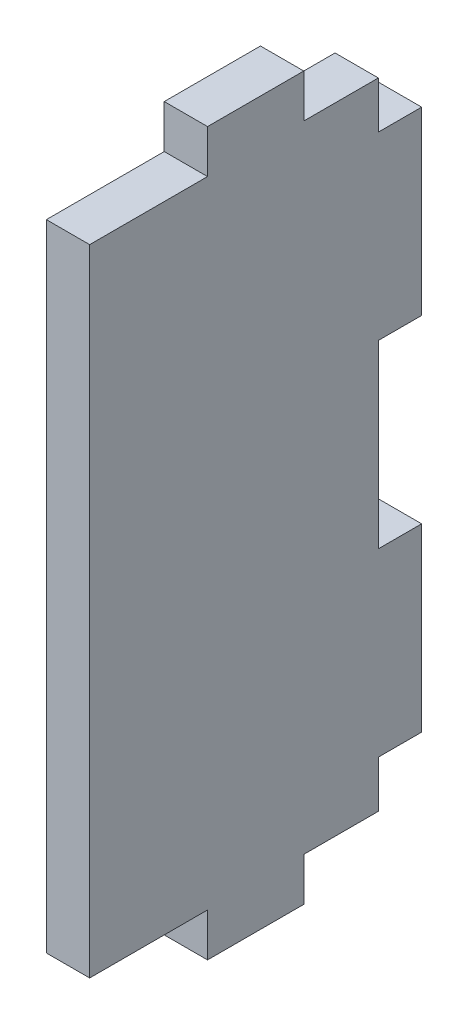
ISO-10303-21;
HEADER;
FILE_DESCRIPTION(('STEP AP214'),'2;1');
FILE_NAME('part.step','',(''),(''),'','','');
FILE_SCHEMA(('AUTOMOTIVE_DESIGN { 1 0 10303 214 1 1 1 1 }'));
ENDSEC;
DATA;
#1=APPLICATION_CONTEXT('core data for automotive mechanical design processes');
#2=APPLICATION_PROTOCOL_DEFINITION('international standard','automotive_design',2000,#1);
#3=PRODUCT_CONTEXT('',#1,'mechanical');
#4=PRODUCT('Part','Part','',(#3));
#5=PRODUCT_RELATED_PRODUCT_CATEGORY('part','',(#4));
#6=PRODUCT_DEFINITION_FORMATION('','',#4);
#7=PRODUCT_DEFINITION_CONTEXT('part definition',#1,'design');
#8=PRODUCT_DEFINITION('design','',#6,#7);
#9=PRODUCT_DEFINITION_SHAPE('','',#8);
#10=(LENGTH_UNIT() NAMED_UNIT(*) SI_UNIT(.MILLI.,.METRE.));
#11=(NAMED_UNIT(*) PLANE_ANGLE_UNIT() SI_UNIT($,.RADIAN.));
#12=(NAMED_UNIT(*) SI_UNIT($,.STERADIAN.) SOLID_ANGLE_UNIT());
#13=UNCERTAINTY_MEASURE_WITH_UNIT(LENGTH_MEASURE(1.E-05),#10,'distance_accuracy_value','');
#14=(GEOMETRIC_REPRESENTATION_CONTEXT(3) GLOBAL_UNCERTAINTY_ASSIGNED_CONTEXT((#13)) GLOBAL_UNIT_ASSIGNED_CONTEXT((#10,
#11,#12)) REPRESENTATION_CONTEXT('',''));
#15=CARTESIAN_POINT('',(0.,0.,0.));
#16=DIRECTION('',(0.,0.,1.));
#17=DIRECTION('',(1.,0.,0.));
#18=AXIS2_PLACEMENT_3D('',#15,#16,#17);
#19=CARTESIAN_POINT('',(0.,75.,69.));
#20=DIRECTION('',(0.,-1.,0.));
#21=DIRECTION('',(0.,0.,-1.));
#22=AXIS2_PLACEMENT_3D('',#19,#20,#21);
#23=PLANE('',#22);
#24=DIRECTION('',(0.,0.,-1.));
#25=VECTOR('',#24,1.);
#26=CARTESIAN_POINT('',(-140.,75.,69.));
#27=LINE('',#26,#25);
#28=CARTESIAN_POINT('',(-140.,75.,44.5));
#29=VERTEX_POINT('',#28);
#30=CARTESIAN_POINT('',(-140.,75.,24.5));
#31=VERTEX_POINT('',#30);
#32=EDGE_CURVE('E191',#29,#31,#27,.T.);
#33=ORIENTED_EDGE('',*,*,#32,.F.);
#34=DIRECTION('',(-1.,0.,0.));
#35=VECTOR('',#34,1.);
#36=CARTESIAN_POINT('',(250.,75.,44.5));
#37=LINE('',#36,#35);
#38=CARTESIAN_POINT('',(-131.,75.,44.5));
#39=VERTEX_POINT('',#38);
#40=EDGE_CURVE('E171',#39,#29,#37,.T.);
#41=ORIENTED_EDGE('',*,*,#40,.F.);
#42=DIRECTION('',(0.,0.,-1.));
#43=VECTOR('',#42,1.);
#44=CARTESIAN_POINT('',(-131.,75.,69.));
#45=LINE('',#44,#43);
#46=CARTESIAN_POINT('',(-131.,75.,24.5));
#47=VERTEX_POINT('',#46);
#48=EDGE_CURVE('E231',#39,#47,#45,.T.);
#49=ORIENTED_EDGE('',*,*,#48,.T.);
#50=DIRECTION('',(-1.,0.,0.));
#51=VECTOR('',#50,1.);
#52=CARTESIAN_POINT('',(250.,75.,24.5));
#53=LINE('',#52,#51);
#54=EDGE_CURVE('E196',#47,#31,#53,.T.);
#55=ORIENTED_EDGE('',*,*,#54,.T.);
#56=EDGE_LOOP('',(#33,#41,#49,#55));
#57=FACE_BOUND('',#56,.T.);
#58=ADVANCED_FACE('F35',(#57),#23,.F.);
#59=CARTESIAN_POINT('',(-140.,0.,69.));
#60=DIRECTION('',(-1.,0.,0.));
#61=DIRECTION('',(0.,0.,1.));
#62=AXIS2_PLACEMENT_3D('',#59,#60,#61);
#63=PLANE('',#62);
#64=DIRECTION('',(0.,1.,0.));
#65=VECTOR('',#64,1.);
#66=CARTESIAN_POINT('',(-140.,0.,9.));
#67=LINE('',#66,#65);
#68=CARTESIAN_POINT('',(-140.,-66.,9.));
#69=VERTEX_POINT('',#68);
#70=CARTESIAN_POINT('',(-140.,-56.25,9.));
#71=VERTEX_POINT('',#70);
#72=EDGE_CURVE('E240',#69,#71,#67,.T.);
#73=ORIENTED_EDGE('',*,*,#72,.F.);
#74=DIRECTION('',(0.,0.,1.));
#75=VECTOR('',#74,1.);
#76=CARTESIAN_POINT('',(-140.,-66.,0.));
#77=LINE('',#76,#75);
#78=CARTESIAN_POINT('',(-140.,-66.,24.5));
#79=VERTEX_POINT('',#78);
#80=EDGE_CURVE('E313',#69,#79,#77,.T.);
#81=ORIENTED_EDGE('',*,*,#80,.T.);
#82=DIRECTION('',(0.,1.,0.));
#83=VECTOR('',#82,1.);
#84=CARTESIAN_POINT('',(-140.,0.,24.5));
#85=LINE('',#84,#83);
#86=CARTESIAN_POINT('',(-140.,-75.,24.5));
#87=VERTEX_POINT('',#86);
#88=EDGE_CURVE('E318',#87,#79,#85,.T.);
#89=ORIENTED_EDGE('',*,*,#88,.F.);
#90=DIRECTION('',(0.,0.,-1.));
#91=VECTOR('',#90,1.);
#92=CARTESIAN_POINT('',(-140.,-75.,69.));
#93=LINE('',#92,#91);
#94=CARTESIAN_POINT('',(-140.,-75.,44.5));
#95=VERTEX_POINT('',#94);
#96=EDGE_CURVE('E198',#95,#87,#93,.T.);
#97=ORIENTED_EDGE('',*,*,#96,.F.);
#98=DIRECTION('',(0.,1.,0.));
#99=VECTOR('',#98,1.);
#100=CARTESIAN_POINT('',(-140.,0.,44.5));
#101=LINE('',#100,#99);
#102=CARTESIAN_POINT('',(-140.,-66.,44.5));
#103=VERTEX_POINT('',#102);
#104=EDGE_CURVE('E323',#95,#103,#101,.T.);
#105=ORIENTED_EDGE('',*,*,#104,.T.);
#106=DIRECTION('',(0.,0.,1.));
#107=VECTOR('',#106,1.);
#108=CARTESIAN_POINT('',(-140.,-66.,0.));
#109=LINE('',#108,#107);
#110=CARTESIAN_POINT('',(-140.,-66.,69.));
#111=VERTEX_POINT('',#110);
#112=EDGE_CURVE('E315',#103,#111,#109,.T.);
#113=ORIENTED_EDGE('',*,*,#112,.T.);
#114=DIRECTION('',(0.,1.,0.));
#115=VECTOR('',#114,1.);
#116=CARTESIAN_POINT('',(-140.,0.,69.));
#117=LINE('',#116,#115);
#118=CARTESIAN_POINT('',(-140.,66.,69.));
#119=VERTEX_POINT('',#118);
#120=EDGE_CURVE('E237',#111,#119,#117,.T.);
#121=ORIENTED_EDGE('',*,*,#120,.T.);
#122=DIRECTION('',(0.,0.,1.));
#123=VECTOR('',#122,1.);
#124=CARTESIAN_POINT('',(-140.,66.,0.));
#125=LINE('',#124,#123);
#126=CARTESIAN_POINT('',(-140.,66.,44.5));
#127=VERTEX_POINT('',#126);
#128=EDGE_CURVE('E184',#127,#119,#125,.T.);
#129=ORIENTED_EDGE('',*,*,#128,.F.);
#130=DIRECTION('',(0.,-1.,0.));
#131=VECTOR('',#130,1.);
#132=CARTESIAN_POINT('',(-140.,0.,44.5));
#133=LINE('',#132,#131);
#134=EDGE_CURVE('E175',#29,#127,#133,.T.);
#135=ORIENTED_EDGE('',*,*,#134,.F.);
#136=ORIENTED_EDGE('',*,*,#32,.T.);
#137=DIRECTION('',(0.,-1.,0.));
#138=VECTOR('',#137,1.);
#139=CARTESIAN_POINT('',(-140.,0.,24.5));
#140=LINE('',#139,#138);
#141=CARTESIAN_POINT('',(-140.,66.,24.5));
#142=VERTEX_POINT('',#141);
#143=EDGE_CURVE('E309',#31,#142,#140,.T.);
#144=ORIENTED_EDGE('',*,*,#143,.T.);
#145=DIRECTION('',(0.,0.,1.));
#146=VECTOR('',#145,1.);
#147=CARTESIAN_POINT('',(-140.,66.,0.));
#148=LINE('',#147,#146);
#149=CARTESIAN_POINT('',(-140.,66.,9.));
#150=VERTEX_POINT('',#149);
#151=EDGE_CURVE('E306',#150,#142,#148,.T.);
#152=ORIENTED_EDGE('',*,*,#151,.F.);
#153=CARTESIAN_POINT('',(-140.,56.25,9.));
#154=VERTEX_POINT('',#153);
#155=EDGE_CURVE('E243',#154,#150,#67,.T.);
#156=ORIENTED_EDGE('',*,*,#155,.F.);
#157=DIRECTION('',(0.,0.,-1.));
#158=VECTOR('',#157,1.);
#159=CARTESIAN_POINT('',(-140.,56.25,47.5648803965473));
#160=LINE('',#159,#158);
#161=CARTESIAN_POINT('',(-140.,56.25,0.));
#162=VERTEX_POINT('',#161);
#163=EDGE_CURVE('E252',#154,#162,#160,.T.);
#164=ORIENTED_EDGE('',*,*,#163,.T.);
#165=DIRECTION('',(0.,-1.,0.));
#166=VECTOR('',#165,1.);
#167=CARTESIAN_POINT('',(-140.,0.,0.));
#168=LINE('',#167,#166);
#169=CARTESIAN_POINT('',(-140.,18.75,0.));
#170=VERTEX_POINT('',#169);
#171=EDGE_CURVE('E261',#162,#170,#168,.T.);
#172=ORIENTED_EDGE('',*,*,#171,.T.);
#173=DIRECTION('',(0.,0.,-1.));
#174=VECTOR('',#173,1.);
#175=CARTESIAN_POINT('',(-140.,18.75,47.5648803965473));
#176=LINE('',#175,#174);
#177=CARTESIAN_POINT('',(-140.,18.75,9.00000000000001));
#178=VERTEX_POINT('',#177);
#179=EDGE_CURVE('E254',#178,#170,#176,.T.);
#180=ORIENTED_EDGE('',*,*,#179,.F.);
#181=CARTESIAN_POINT('',(-140.,-18.75,9.));
#182=VERTEX_POINT('',#181);
#183=EDGE_CURVE('E242',#182,#178,#67,.T.);
#184=ORIENTED_EDGE('',*,*,#183,.F.);
#185=DIRECTION('',(0.,0.,-1.));
#186=VECTOR('',#185,1.);
#187=CARTESIAN_POINT('',(-140.,-18.75,47.5648803965473));
#188=LINE('',#187,#186);
#189=CARTESIAN_POINT('',(-140.,-18.75,0.));
#190=VERTEX_POINT('',#189);
#191=EDGE_CURVE('E273',#182,#190,#188,.T.);
#192=ORIENTED_EDGE('',*,*,#191,.T.);
#193=DIRECTION('',(0.,-1.,0.));
#194=VECTOR('',#193,1.);
#195=CARTESIAN_POINT('',(-140.,0.,0.));
#196=LINE('',#195,#194);
#197=CARTESIAN_POINT('',(-140.,-56.25,0.));
#198=VERTEX_POINT('',#197);
#199=EDGE_CURVE('E288',#190,#198,#196,.T.);
#200=ORIENTED_EDGE('',*,*,#199,.T.);
#201=DIRECTION('',(0.,0.,-1.));
#202=VECTOR('',#201,1.);
#203=CARTESIAN_POINT('',(-140.,-56.25,47.5648803965473));
#204=LINE('',#203,#202);
#205=EDGE_CURVE('E276',#71,#198,#204,.T.);
#206=ORIENTED_EDGE('',*,*,#205,.F.);
#207=EDGE_LOOP('',(#73,#81,#89,#97,#105,#113,#121,#129,#135,#136,#144,#152,#156,#164,#172,#180,
#184,#192,#200,#206));
#208=FACE_BOUND('',#207,.T.);
#209=ADVANCED_FACE('F189',(#208),#63,.T.);
#210=CARTESIAN_POINT('',(0.,-75.,69.));
#211=DIRECTION('',(0.,-1.,0.));
#212=DIRECTION('',(0.,0.,-1.));
#213=AXIS2_PLACEMENT_3D('',#210,#211,#212);
#214=PLANE('',#213);
#215=DIRECTION('',(-1.,0.,0.));
#216=VECTOR('',#215,1.);
#217=CARTESIAN_POINT('',(250.,-75.,24.5));
#218=LINE('',#217,#216);
#219=CARTESIAN_POINT('',(-131.,-75.,24.5));
#220=VERTEX_POINT('',#219);
#221=EDGE_CURVE('E230',#220,#87,#218,.T.);
#222=ORIENTED_EDGE('',*,*,#221,.F.);
#223=DIRECTION('',(0.,0.,-1.));
#224=VECTOR('',#223,1.);
#225=CARTESIAN_POINT('',(-131.,-75.,69.));
#226=LINE('',#225,#224);
#227=CARTESIAN_POINT('',(-131.,-75.,44.5));
#228=VERTEX_POINT('',#227);
#229=EDGE_CURVE('E204',#228,#220,#226,.T.);
#230=ORIENTED_EDGE('',*,*,#229,.F.);
#231=DIRECTION('',(-1.,0.,0.));
#232=VECTOR('',#231,1.);
#233=CARTESIAN_POINT('',(250.,-75.,44.5));
#234=LINE('',#233,#232);
#235=EDGE_CURVE('E193',#228,#95,#234,.T.);
#236=ORIENTED_EDGE('',*,*,#235,.T.);
#237=ORIENTED_EDGE('',*,*,#96,.T.);
#238=EDGE_LOOP('',(#222,#230,#236,#237));
#239=FACE_BOUND('',#238,.T.);
#240=ADVANCED_FACE('F228',(#239),#214,.T.);
#241=CARTESIAN_POINT('',(-131.,0.,69.));
#242=DIRECTION('',(1.,0.,0.));
#243=DIRECTION('',(0.,0.,-1.));
#244=AXIS2_PLACEMENT_3D('',#241,#242,#243);
#245=PLANE('',#244);
#246=DIRECTION('',(0.,-1.,0.));
#247=VECTOR('',#246,1.);
#248=CARTESIAN_POINT('',(-131.,0.,24.5));
#249=LINE('',#248,#247);
#250=CARTESIAN_POINT('',(-131.,-66.,24.5));
#251=VERTEX_POINT('',#250);
#252=EDGE_CURVE('E11',#251,#220,#249,.T.);
#253=ORIENTED_EDGE('',*,*,#252,.F.);
#254=DIRECTION('',(0.,0.,-1.));
#255=VECTOR('',#254,1.);
#256=CARTESIAN_POINT('',(-131.,-66.,69.));
#257=LINE('',#256,#255);
#258=CARTESIAN_POINT('',(-131.,-66.,9.));
#259=VERTEX_POINT('',#258);
#260=EDGE_CURVE('E302',#251,#259,#257,.T.);
#261=ORIENTED_EDGE('',*,*,#260,.T.);
#262=DIRECTION('',(0.,-1.,0.));
#263=VECTOR('',#262,1.);
#264=CARTESIAN_POINT('',(-131.,0.,9.));
#265=LINE('',#264,#263);
#266=CARTESIAN_POINT('',(-131.,-56.25,9.00000000000001));
#267=VERTEX_POINT('',#266);
#268=EDGE_CURVE('E239',#267,#259,#265,.T.);
#269=ORIENTED_EDGE('',*,*,#268,.F.);
#270=DIRECTION('',(0.,0.,-1.));
#271=VECTOR('',#270,1.);
#272=CARTESIAN_POINT('',(-131.,-56.25,47.5648803965473));
#273=LINE('',#272,#271);
#274=CARTESIAN_POINT('',(-131.,-56.25,0.));
#275=VERTEX_POINT('',#274);
#276=EDGE_CURVE('E278',#267,#275,#273,.T.);
#277=ORIENTED_EDGE('',*,*,#276,.T.);
#278=DIRECTION('',(0.,-1.,0.));
#279=VECTOR('',#278,1.);
#280=CARTESIAN_POINT('',(-131.,0.,0.));
#281=LINE('',#280,#279);
#282=CARTESIAN_POINT('',(-131.,-18.75,0.));
#283=VERTEX_POINT('',#282);
#284=EDGE_CURVE('E282',#283,#275,#281,.T.);
#285=ORIENTED_EDGE('',*,*,#284,.F.);
#286=DIRECTION('',(0.,0.,-1.));
#287=VECTOR('',#286,1.);
#288=CARTESIAN_POINT('',(-131.,-18.75,47.5648803965473));
#289=LINE('',#288,#287);
#290=CARTESIAN_POINT('',(-131.,-18.75,9.));
#291=VERTEX_POINT('',#290);
#292=EDGE_CURVE('E280',#291,#283,#289,.T.);
#293=ORIENTED_EDGE('',*,*,#292,.F.);
#294=CARTESIAN_POINT('',(-131.,18.75,9.));
#295=VERTEX_POINT('',#294);
#296=EDGE_CURVE('E238',#295,#291,#265,.T.);
#297=ORIENTED_EDGE('',*,*,#296,.F.);
#298=DIRECTION('',(0.,0.,-1.));
#299=VECTOR('',#298,1.);
#300=CARTESIAN_POINT('',(-131.,18.75,47.5648803965473));
#301=LINE('',#300,#299);
#302=CARTESIAN_POINT('',(-131.,18.75,0.));
#303=VERTEX_POINT('',#302);
#304=EDGE_CURVE('E256',#295,#303,#301,.T.);
#305=ORIENTED_EDGE('',*,*,#304,.T.);
#306=DIRECTION('',(0.,-1.,0.));
#307=VECTOR('',#306,1.);
#308=CARTESIAN_POINT('',(-131.,0.,0.));
#309=LINE('',#308,#307);
#310=CARTESIAN_POINT('',(-131.,56.25,0.));
#311=VERTEX_POINT('',#310);
#312=EDGE_CURVE('E267',#311,#303,#309,.T.);
#313=ORIENTED_EDGE('',*,*,#312,.F.);
#314=DIRECTION('',(0.,0.,-1.));
#315=VECTOR('',#314,1.);
#316=CARTESIAN_POINT('',(-131.,56.25,47.5648803965473));
#317=LINE('',#316,#315);
#318=CARTESIAN_POINT('',(-131.,56.25,9.));
#319=VERTEX_POINT('',#318);
#320=EDGE_CURVE('E250',#319,#311,#317,.T.);
#321=ORIENTED_EDGE('',*,*,#320,.F.);
#322=CARTESIAN_POINT('',(-131.,66.,9.));
#323=VERTEX_POINT('',#322);
#324=EDGE_CURVE('E235',#323,#319,#265,.T.);
#325=ORIENTED_EDGE('',*,*,#324,.F.);
#326=DIRECTION('',(0.,0.,-1.));
#327=VECTOR('',#326,1.);
#328=CARTESIAN_POINT('',(-131.,66.,69.));
#329=LINE('',#328,#327);
#330=CARTESIAN_POINT('',(-131.,66.,24.5));
#331=VERTEX_POINT('',#330);
#332=EDGE_CURVE('E212',#331,#323,#329,.T.);
#333=ORIENTED_EDGE('',*,*,#332,.F.);
#334=DIRECTION('',(0.,1.,0.));
#335=VECTOR('',#334,1.);
#336=CARTESIAN_POINT('',(-131.,0.,24.5));
#337=LINE('',#336,#335);
#338=EDGE_CURVE('E214',#331,#47,#337,.T.);
#339=ORIENTED_EDGE('',*,*,#338,.T.);
#340=ORIENTED_EDGE('',*,*,#48,.F.);
#341=DIRECTION('',(0.,1.,0.));
#342=VECTOR('',#341,1.);
#343=CARTESIAN_POINT('',(-131.,0.,44.5));
#344=LINE('',#343,#342);
#345=CARTESIAN_POINT('',(-131.,66.,44.5));
#346=VERTEX_POINT('',#345);
#347=EDGE_CURVE('E178',#346,#39,#344,.T.);
#348=ORIENTED_EDGE('',*,*,#347,.F.);
#349=DIRECTION('',(0.,0.,-1.));
#350=VECTOR('',#349,1.);
#351=CARTESIAN_POINT('',(-131.,66.,69.));
#352=LINE('',#351,#350);
#353=CARTESIAN_POINT('',(-131.,66.,69.));
#354=VERTEX_POINT('',#353);
#355=EDGE_CURVE('E300',#354,#346,#352,.T.);
#356=ORIENTED_EDGE('',*,*,#355,.F.);
#357=DIRECTION('',(0.,-1.,0.));
#358=VECTOR('',#357,1.);
#359=CARTESIAN_POINT('',(-131.,0.,69.));
#360=LINE('',#359,#358);
#361=CARTESIAN_POINT('',(-131.,-66.,69.));
#362=VERTEX_POINT('',#361);
#363=EDGE_CURVE('E232',#354,#362,#360,.T.);
#364=ORIENTED_EDGE('',*,*,#363,.T.);
#365=DIRECTION('',(0.,0.,-1.));
#366=VECTOR('',#365,1.);
#367=CARTESIAN_POINT('',(-131.,-66.,68.9999999999999));
#368=LINE('',#367,#366);
#369=CARTESIAN_POINT('',(-131.,-66.,44.5));
#370=VERTEX_POINT('',#369);
#371=EDGE_CURVE('E57',#362,#370,#368,.T.);
#372=ORIENTED_EDGE('',*,*,#371,.T.);
#373=DIRECTION('',(0.,-1.,0.));
#374=VECTOR('',#373,1.);
#375=CARTESIAN_POINT('',(-131.,0.,44.5));
#376=LINE('',#375,#374);
#377=EDGE_CURVE('E42',#370,#228,#376,.T.);
#378=ORIENTED_EDGE('',*,*,#377,.T.);
#379=ORIENTED_EDGE('',*,*,#229,.T.);
#380=EDGE_LOOP('',(#253,#261,#269,#277,#285,#293,#297,#305,#313,#321,#325,#333,#339,#340,#348,
#356,#364,#372,#378,#379));
#381=FACE_BOUND('',#380,.T.);
#382=ADVANCED_FACE('F222',(#381),#245,.T.);
#383=CARTESIAN_POINT('',(0.,0.,69.));
#384=DIRECTION('',(0.,0.,-1.));
#385=DIRECTION('',(-1.,0.,0.));
#386=AXIS2_PLACEMENT_3D('',#383,#384,#385);
#387=PLANE('',#386);
#388=DIRECTION('',(-1.,0.,0.));
#389=VECTOR('',#388,1.);
#390=CARTESIAN_POINT('',(0.,-66.,69.));
#391=LINE('',#390,#389);
#392=EDGE_CURVE('E210',#362,#111,#391,.T.);
#393=ORIENTED_EDGE('',*,*,#392,.F.);
#394=ORIENTED_EDGE('',*,*,#363,.F.);
#395=DIRECTION('',(-1.,0.,0.));
#396=VECTOR('',#395,1.);
#397=CARTESIAN_POINT('',(0.,66.,69.));
#398=LINE('',#397,#396);
#399=EDGE_CURVE('E201',#354,#119,#398,.T.);
#400=ORIENTED_EDGE('',*,*,#399,.T.);
#401=ORIENTED_EDGE('',*,*,#120,.F.);
#402=EDGE_LOOP('',(#393,#394,#400,#401));
#403=FACE_BOUND('',#402,.T.);
#404=ADVANCED_FACE('F336',(#403),#387,.F.);
#405=CARTESIAN_POINT('',(0.,0.,9.));
#406=DIRECTION('',(0.,0.,-1.));
#407=DIRECTION('',(-1.,0.,0.));
#408=AXIS2_PLACEMENT_3D('',#405,#406,#407);
#409=PLANE('',#408);
#410=ORIENTED_EDGE('',*,*,#268,.T.);
#411=DIRECTION('',(-1.,0.,0.));
#412=VECTOR('',#411,1.);
#413=CARTESIAN_POINT('',(0.,-66.,9.));
#414=LINE('',#413,#412);
#415=EDGE_CURVE('E197',#259,#69,#414,.T.);
#416=ORIENTED_EDGE('',*,*,#415,.T.);
#417=ORIENTED_EDGE('',*,*,#72,.T.);
#418=DIRECTION('',(1.,0.,0.));
#419=VECTOR('',#418,1.);
#420=CARTESIAN_POINT('',(0.,-56.25,9.));
#421=LINE('',#420,#419);
#422=EDGE_CURVE('E275',#71,#267,#421,.T.);
#423=ORIENTED_EDGE('',*,*,#422,.T.);
#424=EDGE_LOOP('',(#410,#416,#417,#423));
#425=FACE_BOUND('',#424,.T.);
#426=ADVANCED_FACE('F368',(#425),#409,.T.);
#427=DIRECTION('',(-1.,0.,0.));
#428=VECTOR('',#427,1.);
#429=CARTESIAN_POINT('',(0.,-18.75,9.));
#430=LINE('',#429,#428);
#431=EDGE_CURVE('E270',#291,#182,#430,.T.);
#432=ORIENTED_EDGE('',*,*,#431,.T.);
#433=ORIENTED_EDGE('',*,*,#183,.T.);
#434=DIRECTION('',(-1.,0.,0.));
#435=VECTOR('',#434,1.);
#436=CARTESIAN_POINT('',(0.,18.75,9.));
#437=LINE('',#436,#435);
#438=EDGE_CURVE('E246',#295,#178,#437,.T.);
#439=ORIENTED_EDGE('',*,*,#438,.F.);
#440=ORIENTED_EDGE('',*,*,#296,.T.);
#441=EDGE_LOOP('',(#432,#433,#439,#440));
#442=FACE_BOUND('',#441,.T.);
#443=ADVANCED_FACE('F353',(#442),#409,.T.);
#444=DIRECTION('',(-1.,0.,0.));
#445=VECTOR('',#444,1.);
#446=CARTESIAN_POINT('',(0.,66.,9.));
#447=LINE('',#446,#445);
#448=EDGE_CURVE('E294',#323,#150,#447,.T.);
#449=ORIENTED_EDGE('',*,*,#448,.F.);
#450=ORIENTED_EDGE('',*,*,#324,.T.);
#451=DIRECTION('',(1.,0.,0.));
#452=VECTOR('',#451,1.);
#453=CARTESIAN_POINT('',(0.,56.25,9.));
#454=LINE('',#453,#452);
#455=EDGE_CURVE('E249',#154,#319,#454,.T.);
#456=ORIENTED_EDGE('',*,*,#455,.F.);
#457=ORIENTED_EDGE('',*,*,#155,.T.);
#458=EDGE_LOOP('',(#449,#450,#456,#457));
#459=FACE_BOUND('',#458,.T.);
#460=ADVANCED_FACE('F349',(#459),#409,.T.);
#461=CARTESIAN_POINT('',(0.,0.,0.));
#462=DIRECTION('',(0.,0.,1.));
#463=DIRECTION('',(1.,0.,0.));
#464=AXIS2_PLACEMENT_3D('',#461,#462,#463);
#465=PLANE('',#464);
#466=ORIENTED_EDGE('',*,*,#312,.T.);
#467=DIRECTION('',(1.,0.,0.));
#468=VECTOR('',#467,1.);
#469=CARTESIAN_POINT('',(0.,18.75,0.));
#470=LINE('',#469,#468);
#471=EDGE_CURVE('E258',#170,#303,#470,.T.);
#472=ORIENTED_EDGE('',*,*,#471,.F.);
#473=ORIENTED_EDGE('',*,*,#171,.F.);
#474=DIRECTION('',(-1.,0.,0.));
#475=VECTOR('',#474,1.);
#476=CARTESIAN_POINT('',(0.,56.25,0.));
#477=LINE('',#476,#475);
#478=EDGE_CURVE('E264',#311,#162,#477,.T.);
#479=ORIENTED_EDGE('',*,*,#478,.F.);
#480=EDGE_LOOP('',(#466,#472,#473,#479));
#481=FACE_BOUND('',#480,.T.);
#482=ADVANCED_FACE('F414',(#481),#465,.F.);
#483=CARTESIAN_POINT('',(0.,18.75,47.5648803965473));
#484=DIRECTION('',(0.,1.,0.));
#485=DIRECTION('',(0.,0.,1.));
#486=AXIS2_PLACEMENT_3D('',#483,#484,#485);
#487=PLANE('',#486);
#488=ORIENTED_EDGE('',*,*,#304,.F.);
#489=ORIENTED_EDGE('',*,*,#438,.T.);
#490=ORIENTED_EDGE('',*,*,#179,.T.);
#491=ORIENTED_EDGE('',*,*,#471,.T.);
#492=EDGE_LOOP('',(#488,#489,#490,#491));
#493=FACE_BOUND('',#492,.T.);
#494=ADVANCED_FACE('F361',(#493),#487,.F.);
#495=CARTESIAN_POINT('',(0.,56.25,47.5648803965473));
#496=DIRECTION('',(0.,-1.,0.));
#497=DIRECTION('',(0.,0.,-1.));
#498=AXIS2_PLACEMENT_3D('',#495,#496,#497);
#499=PLANE('',#498);
#500=ORIENTED_EDGE('',*,*,#163,.F.);
#501=ORIENTED_EDGE('',*,*,#455,.T.);
#502=ORIENTED_EDGE('',*,*,#320,.T.);
#503=ORIENTED_EDGE('',*,*,#478,.T.);
#504=EDGE_LOOP('',(#500,#501,#502,#503));
#505=FACE_BOUND('',#504,.T.);
#506=ADVANCED_FACE('F388',(#505),#499,.F.);
#507=CARTESIAN_POINT('',(0.,-18.75,47.5648803965473));
#508=DIRECTION('',(0.,1.,0.));
#509=DIRECTION('',(0.,0.,1.));
#510=AXIS2_PLACEMENT_3D('',#507,#508,#509);
#511=PLANE('',#510);
#512=ORIENTED_EDGE('',*,*,#431,.F.);
#513=ORIENTED_EDGE('',*,*,#292,.T.);
#514=DIRECTION('',(1.,0.,0.));
#515=VECTOR('',#514,1.);
#516=CARTESIAN_POINT('',(0.,-18.75,0.));
#517=LINE('',#516,#515);
#518=EDGE_CURVE('E291',#190,#283,#517,.T.);
#519=ORIENTED_EDGE('',*,*,#518,.F.);
#520=ORIENTED_EDGE('',*,*,#191,.F.);
#521=EDGE_LOOP('',(#512,#513,#519,#520));
#522=FACE_BOUND('',#521,.T.);
#523=ADVANCED_FACE('F386',(#522),#511,.T.);
#524=CARTESIAN_POINT('',(0.,-56.25,47.5648803965473));
#525=DIRECTION('',(0.,-1.,0.));
#526=DIRECTION('',(0.,0.,-1.));
#527=AXIS2_PLACEMENT_3D('',#524,#525,#526);
#528=PLANE('',#527);
#529=ORIENTED_EDGE('',*,*,#422,.F.);
#530=ORIENTED_EDGE('',*,*,#205,.T.);
#531=DIRECTION('',(-1.,0.,0.));
#532=VECTOR('',#531,1.);
#533=CARTESIAN_POINT('',(0.,-56.25,0.));
#534=LINE('',#533,#532);
#535=EDGE_CURVE('E285',#275,#198,#534,.T.);
#536=ORIENTED_EDGE('',*,*,#535,.F.);
#537=ORIENTED_EDGE('',*,*,#276,.F.);
#538=EDGE_LOOP('',(#529,#530,#536,#537));
#539=FACE_BOUND('',#538,.T.);
#540=ADVANCED_FACE('F380',(#539),#528,.T.);
#541=CARTESIAN_POINT('',(0.,0.,0.));
#542=DIRECTION('',(0.,0.,1.));
#543=DIRECTION('',(1.,0.,0.));
#544=AXIS2_PLACEMENT_3D('',#541,#542,#543);
#545=PLANE('',#544);
#546=ORIENTED_EDGE('',*,*,#518,.T.);
#547=ORIENTED_EDGE('',*,*,#284,.T.);
#548=ORIENTED_EDGE('',*,*,#535,.T.);
#549=ORIENTED_EDGE('',*,*,#199,.F.);
#550=EDGE_LOOP('',(#546,#547,#548,#549));
#551=FACE_BOUND('',#550,.T.);
#552=ADVANCED_FACE('F383',(#551),#545,.F.);
#553=CARTESIAN_POINT('',(250.,-66.,0.));
#554=DIRECTION('',(0.,-1.,0.));
#555=DIRECTION('',(0.,0.,-1.));
#556=AXIS2_PLACEMENT_3D('',#553,#554,#555);
#557=PLANE('',#556);
#558=DIRECTION('',(-1.,0.,0.));
#559=VECTOR('',#558,1.);
#560=CARTESIAN_POINT('',(250.,-66.,24.5));
#561=LINE('',#560,#559);
#562=EDGE_CURVE('E312',#251,#79,#561,.T.);
#563=ORIENTED_EDGE('',*,*,#562,.T.);
#564=ORIENTED_EDGE('',*,*,#80,.F.);
#565=ORIENTED_EDGE('',*,*,#415,.F.);
#566=ORIENTED_EDGE('',*,*,#260,.F.);
#567=EDGE_LOOP('',(#563,#564,#565,#566));
#568=FACE_BOUND('',#567,.T.);
#569=ADVANCED_FACE('F374',(#568),#557,.T.);
#570=CARTESIAN_POINT('',(250.,0.,24.5));
#571=DIRECTION('',(0.,0.,1.));
#572=DIRECTION('',(0.,-1.,0.));
#573=AXIS2_PLACEMENT_3D('',#570,#571,#572);
#574=PLANE('',#573);
#575=ORIENTED_EDGE('',*,*,#252,.T.);
#576=ORIENTED_EDGE('',*,*,#221,.T.);
#577=ORIENTED_EDGE('',*,*,#88,.T.);
#578=ORIENTED_EDGE('',*,*,#562,.F.);
#579=EDGE_LOOP('',(#575,#576,#577,#578));
#580=FACE_BOUND('',#579,.T.);
#581=ADVANCED_FACE('F376',(#580),#574,.F.);
#582=CARTESIAN_POINT('',(250.,66.,0.));
#583=DIRECTION('',(0.,-1.,0.));
#584=DIRECTION('',(0.,0.,-1.));
#585=AXIS2_PLACEMENT_3D('',#582,#583,#584);
#586=PLANE('',#585);
#587=ORIENTED_EDGE('',*,*,#355,.T.);
#588=DIRECTION('',(-1.,0.,0.));
#589=VECTOR('',#588,1.);
#590=CARTESIAN_POINT('',(250.,66.,44.5));
#591=LINE('',#590,#589);
#592=EDGE_CURVE('E183',#346,#127,#591,.T.);
#593=ORIENTED_EDGE('',*,*,#592,.T.);
#594=ORIENTED_EDGE('',*,*,#128,.T.);
#595=ORIENTED_EDGE('',*,*,#399,.F.);
#596=EDGE_LOOP('',(#587,#593,#594,#595));
#597=FACE_BOUND('',#596,.T.);
#598=ADVANCED_FACE('F331',(#597),#586,.F.);
#599=CARTESIAN_POINT('',(250.,0.,44.5));
#600=DIRECTION('',(0.,0.,-1.));
#601=DIRECTION('',(-1.,0.,0.));
#602=AXIS2_PLACEMENT_3D('',#599,#600,#601);
#603=PLANE('',#602);
#604=ORIENTED_EDGE('',*,*,#347,.T.);
#605=ORIENTED_EDGE('',*,*,#40,.T.);
#606=ORIENTED_EDGE('',*,*,#134,.T.);
#607=ORIENTED_EDGE('',*,*,#592,.F.);
#608=EDGE_LOOP('',(#604,#605,#606,#607));
#609=FACE_BOUND('',#608,.T.);
#610=ADVANCED_FACE('F173',(#609),#603,.F.);
#611=CARTESIAN_POINT('',(250.,-66.,0.));
#612=DIRECTION('',(0.,-1.,0.));
#613=DIRECTION('',(0.,0.,-1.));
#614=AXIS2_PLACEMENT_3D('',#611,#612,#613);
#615=PLANE('',#614);
#616=ORIENTED_EDGE('',*,*,#392,.T.);
#617=ORIENTED_EDGE('',*,*,#112,.F.);
#618=DIRECTION('',(-1.,0.,0.));
#619=VECTOR('',#618,1.);
#620=CARTESIAN_POINT('',(250.,-66.,44.5));
#621=LINE('',#620,#619);
#622=EDGE_CURVE('E321',#370,#103,#621,.T.);
#623=ORIENTED_EDGE('',*,*,#622,.F.);
#624=ORIENTED_EDGE('',*,*,#371,.F.);
#625=EDGE_LOOP('',(#616,#617,#623,#624));
#626=FACE_BOUND('',#625,.T.);
#627=ADVANCED_FACE('F338',(#626),#615,.T.);
#628=CARTESIAN_POINT('',(250.,0.,44.5));
#629=DIRECTION('',(0.,0.,1.));
#630=DIRECTION('',(1.,0.,0.));
#631=AXIS2_PLACEMENT_3D('',#628,#629,#630);
#632=PLANE('',#631);
#633=ORIENTED_EDGE('',*,*,#622,.T.);
#634=ORIENTED_EDGE('',*,*,#104,.F.);
#635=ORIENTED_EDGE('',*,*,#235,.F.);
#636=ORIENTED_EDGE('',*,*,#377,.F.);
#637=EDGE_LOOP('',(#633,#634,#635,#636));
#638=FACE_BOUND('',#637,.T.);
#639=ADVANCED_FACE('F544',(#638),#632,.T.);
#640=CARTESIAN_POINT('',(250.,0.,24.5));
#641=DIRECTION('',(0.,0.,-1.));
#642=DIRECTION('',(-1.,0.,0.));
#643=AXIS2_PLACEMENT_3D('',#640,#641,#642);
#644=PLANE('',#643);
#645=DIRECTION('',(-1.,0.,0.));
#646=VECTOR('',#645,1.);
#647=CARTESIAN_POINT('',(250.,66.,24.5));
#648=LINE('',#647,#646);
#649=EDGE_CURVE('E49',#331,#142,#648,.T.);
#650=ORIENTED_EDGE('',*,*,#649,.T.);
#651=ORIENTED_EDGE('',*,*,#143,.F.);
#652=ORIENTED_EDGE('',*,*,#54,.F.);
#653=ORIENTED_EDGE('',*,*,#338,.F.);
#654=EDGE_LOOP('',(#650,#651,#652,#653));
#655=FACE_BOUND('',#654,.T.);
#656=ADVANCED_FACE('F342',(#655),#644,.T.);
#657=CARTESIAN_POINT('',(250.,66.,0.));
#658=DIRECTION('',(0.,-1.,0.));
#659=DIRECTION('',(0.,0.,-1.));
#660=AXIS2_PLACEMENT_3D('',#657,#658,#659);
#661=PLANE('',#660);
#662=ORIENTED_EDGE('',*,*,#448,.T.);
#663=ORIENTED_EDGE('',*,*,#151,.T.);
#664=ORIENTED_EDGE('',*,*,#649,.F.);
#665=ORIENTED_EDGE('',*,*,#332,.T.);
#666=EDGE_LOOP('',(#662,#663,#664,#665));
#667=FACE_BOUND('',#666,.T.);
#668=ADVANCED_FACE('F560',(#667),#661,.F.);
#669=CLOSED_SHELL('',(#58,#209,#240,#382,#404,#426,#443,#460,#482,#494,#506,#523,#540,#552,#569,
#581,#598,#610,#627,#639,#656,#668));
#670=MANIFOLD_SOLID_BREP('B2',#669);
#671=ADVANCED_BREP_SHAPE_REPRESENTATION('',(#18,#670),#14);
#672=SHAPE_DEFINITION_REPRESENTATION(#9,#671);
ENDSEC;
END-ISO-10303-21;
